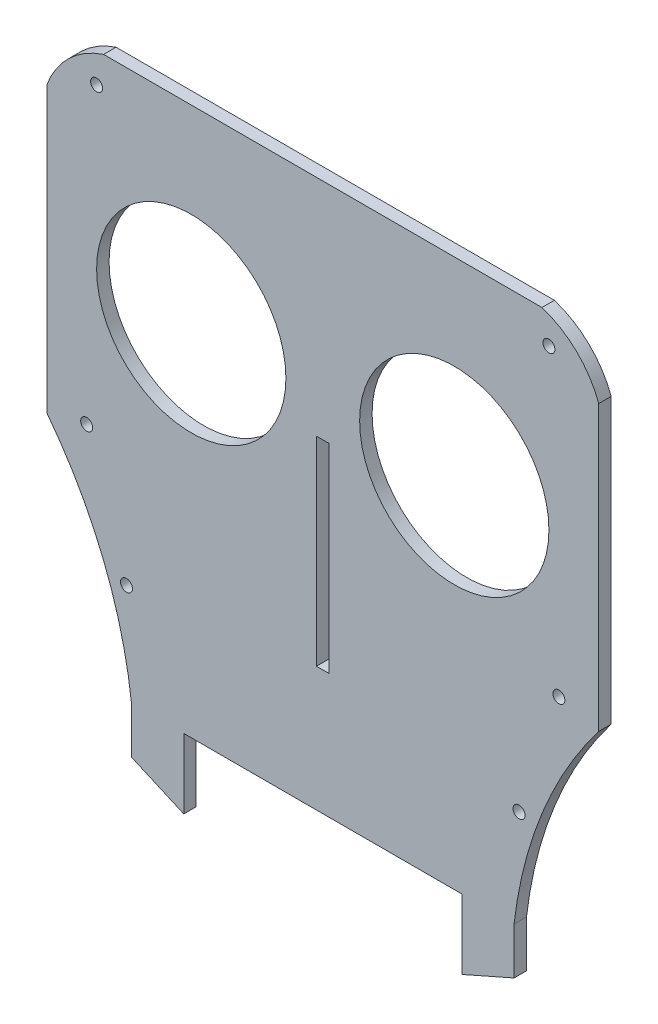
ISO-10303-21;
HEADER;
FILE_DESCRIPTION(('STEP AP214'),'2;1');
FILE_NAME('part.step','',(''),(''),'','','');
FILE_SCHEMA(('AUTOMOTIVE_DESIGN { 1 0 10303 214 1 1 1 1 }'));
ENDSEC;
DATA;
#1=APPLICATION_CONTEXT('core data for automotive mechanical design processes');
#2=APPLICATION_PROTOCOL_DEFINITION('international standard','automotive_design',2000,#1);
#3=PRODUCT_CONTEXT('',#1,'mechanical');
#4=PRODUCT('Part','Part','',(#3));
#5=PRODUCT_RELATED_PRODUCT_CATEGORY('part','',(#4));
#6=PRODUCT_DEFINITION_FORMATION('','',#4);
#7=PRODUCT_DEFINITION_CONTEXT('part definition',#1,'design');
#8=PRODUCT_DEFINITION('design','',#6,#7);
#9=PRODUCT_DEFINITION_SHAPE('','',#8);
#10=(LENGTH_UNIT() NAMED_UNIT(*) SI_UNIT(.MILLI.,.METRE.));
#11=(NAMED_UNIT(*) PLANE_ANGLE_UNIT() SI_UNIT($,.RADIAN.));
#12=(NAMED_UNIT(*) SI_UNIT($,.STERADIAN.) SOLID_ANGLE_UNIT());
#13=UNCERTAINTY_MEASURE_WITH_UNIT(LENGTH_MEASURE(1.E-05),#10,'distance_accuracy_value','');
#14=(GEOMETRIC_REPRESENTATION_CONTEXT(3) GLOBAL_UNCERTAINTY_ASSIGNED_CONTEXT((#13)) GLOBAL_UNIT_ASSIGNED_CONTEXT((#10,
#11,#12)) REPRESENTATION_CONTEXT('',''));
#15=CARTESIAN_POINT('',(0.,0.,0.));
#16=DIRECTION('',(0.,0.,1.));
#17=DIRECTION('',(1.,0.,0.));
#18=AXIS2_PLACEMENT_3D('',#15,#16,#17);
#19=CARTESIAN_POINT('',(-70.358,-139.7,3.175));
#20=DIRECTION('',(0.,1.,0.));
#21=DIRECTION('',(-1.,0.,0.));
#22=AXIS2_PLACEMENT_3D('',#19,#20,#21);
#23=PLANE('',#22);
#24=DIRECTION('',(0.,0.,1.));
#25=VECTOR('',#24,1.);
#26=CARTESIAN_POINT('',(35.433,-139.7,0.));
#27=LINE('',#26,#25);
#28=CARTESIAN_POINT('',(35.433,-139.7,0.));
#29=VERTEX_POINT('',#28);
#30=CARTESIAN_POINT('',(35.433,-139.7,3.175));
#31=VERTEX_POINT('',#30);
#32=EDGE_CURVE('E50',#29,#31,#27,.T.);
#33=ORIENTED_EDGE('',*,*,#32,.T.);
#34=DIRECTION('',(1.,0.,0.));
#35=VECTOR('',#34,1.);
#36=CARTESIAN_POINT('',(-70.358,-139.7,3.175));
#37=LINE('',#36,#35);
#38=CARTESIAN_POINT('',(-35.433,-139.7,3.175));
#39=VERTEX_POINT('',#38);
#40=EDGE_CURVE('E353',#39,#31,#37,.T.);
#41=ORIENTED_EDGE('',*,*,#40,.F.);
#42=DIRECTION('',(0.,0.,1.));
#43=VECTOR('',#42,1.);
#44=CARTESIAN_POINT('',(-35.433,-139.7,0.));
#45=LINE('',#44,#43);
#46=CARTESIAN_POINT('',(-35.433,-139.7,0.));
#47=VERTEX_POINT('',#46);
#48=EDGE_CURVE('E211',#47,#39,#45,.T.);
#49=ORIENTED_EDGE('',*,*,#48,.F.);
#50=DIRECTION('',(1.,0.,0.));
#51=VECTOR('',#50,1.);
#52=CARTESIAN_POINT('',(-70.358,-139.7,0.));
#53=LINE('',#52,#51);
#54=EDGE_CURVE('E55',#47,#29,#53,.T.);
#55=ORIENTED_EDGE('',*,*,#54,.T.);
#56=EDGE_LOOP('',(#33,#41,#49,#55));
#57=FACE_BOUND('',#56,.T.);
#58=ADVANCED_FACE('F33',(#57),#23,.F.);
#59=CARTESIAN_POINT('',(-70.358,-139.7,3.175));
#60=DIRECTION('',(0.,0.,1.));
#61=DIRECTION('',(1.,0.,0.));
#62=AXIS2_PLACEMENT_3D('',#59,#60,#61);
#63=PLANE('',#62);
#64=CARTESIAN_POINT('',(60.198,-83.82,3.175));
#65=DIRECTION('',(0.,0.,-1.));
#66=DIRECTION('',(-1.,0.,0.));
#67=AXIS2_PLACEMENT_3D('',#64,#65,#66);
#68=CIRCLE('',#67,1.52399999999999);
#69=CARTESIAN_POINT('',(58.674,-83.82,3.175));
#70=VERTEX_POINT('',#69);
#71=EDGE_CURVE('E232',#70,#70,#68,.T.);
#72=ORIENTED_EDGE('',*,*,#71,.T.);
#73=EDGE_LOOP('',(#72));
#74=FACE_BOUND('',#73,.T.);
#75=DIRECTION('',(0.,1.,0.));
#76=VECTOR('',#75,1.);
#77=CARTESIAN_POINT('',(70.358,0.,3.175));
#78=LINE('',#77,#76);
#79=CARTESIAN_POINT('',(70.358,-86.36,3.175));
#80=VERTEX_POINT('',#79);
#81=CARTESIAN_POINT('',(70.358,-13.97,3.175));
#82=VERTEX_POINT('',#81);
#83=EDGE_CURVE('E42',#80,#82,#78,.T.);
#84=ORIENTED_EDGE('',*,*,#83,.T.);
#85=CARTESIAN_POINT('',(48.7264391010209,-21.900926749851,3.175));
#86=DIRECTION('',(0.,0.,1.));
#87=DIRECTION('',(1.,0.,0.));
#88=AXIS2_PLACEMENT_3D('',#85,#86,#87);
#89=CIRCLE('',#88,23.0396186174542);
#90=CARTESIAN_POINT('',(55.88,0.,3.175));
#91=VERTEX_POINT('',#90);
#92=EDGE_CURVE('E262',#82,#91,#89,.T.);
#93=ORIENTED_EDGE('',*,*,#92,.T.);
#94=DIRECTION('',(-1.,0.,0.));
#95=VECTOR('',#94,1.);
#96=CARTESIAN_POINT('',(70.358,0.,3.175));
#97=LINE('',#96,#95);
#98=CARTESIAN_POINT('',(-55.88,0.,3.175));
#99=VERTEX_POINT('',#98);
#100=EDGE_CURVE('E11',#91,#99,#97,.T.);
#101=ORIENTED_EDGE('',*,*,#100,.T.);
#102=CARTESIAN_POINT('',(-48.7264391010209,-21.900926749851,3.175));
#103=DIRECTION('',(0.,0.,-1.));
#104=DIRECTION('',(-1.,0.,0.));
#105=AXIS2_PLACEMENT_3D('',#102,#103,#104);
#106=CIRCLE('',#105,23.0396186174542);
#107=CARTESIAN_POINT('',(-70.358,-13.97,3.175));
#108=VERTEX_POINT('',#107);
#109=EDGE_CURVE('E283',#108,#99,#106,.T.);
#110=ORIENTED_EDGE('',*,*,#109,.F.);
#111=DIRECTION('',(0.,-1.,0.));
#112=VECTOR('',#111,1.);
#113=CARTESIAN_POINT('',(-70.358,0.,3.175));
#114=LINE('',#113,#112);
#115=CARTESIAN_POINT('',(-70.358,-86.36,3.175));
#116=VERTEX_POINT('',#115);
#117=EDGE_CURVE('E351',#108,#116,#114,.T.);
#118=ORIENTED_EDGE('',*,*,#117,.T.);
#119=CARTESIAN_POINT('',(-156.00726826817,-152.066965727593,3.175));
#120=DIRECTION('',(0.,0.,1.));
#121=DIRECTION('',(-1.,0.,0.));
#122=AXIS2_PLACEMENT_3D('',#119,#120,#121);
#123=CIRCLE('',#122,107.95);
#124=CARTESIAN_POINT('',(-48.768,-139.7,3.175));
#125=VERTEX_POINT('',#124);
#126=EDGE_CURVE('E294',#125,#116,#123,.T.);
#127=ORIENTED_EDGE('',*,*,#126,.F.);
#128=DIRECTION('',(0.,-1.,0.));
#129=VECTOR('',#128,1.);
#130=CARTESIAN_POINT('',(-48.768,-151.596070027549,3.175));
#131=LINE('',#130,#129);
#132=CARTESIAN_POINT('',(-48.768,-151.596070027549,3.175));
#133=VERTEX_POINT('',#132);
#134=EDGE_CURVE('E190',#125,#133,#131,.T.);
#135=ORIENTED_EDGE('',*,*,#134,.T.);
#136=DIRECTION('',(0.914896473189709,-0.403688547453394,0.));
#137=VECTOR('',#136,1.);
#138=CARTESIAN_POINT('',(-35.433,-157.48,3.175));
#139=LINE('',#138,#137);
#140=CARTESIAN_POINT('',(-35.433,-157.48,3.175));
#141=VERTEX_POINT('',#140);
#142=EDGE_CURVE('E203',#133,#141,#139,.T.);
#143=ORIENTED_EDGE('',*,*,#142,.T.);
#144=DIRECTION('',(0.,1.,0.));
#145=VECTOR('',#144,1.);
#146=CARTESIAN_POINT('',(-35.433,-139.7,3.175));
#147=LINE('',#146,#145);
#148=EDGE_CURVE('E197',#141,#39,#147,.T.);
#149=ORIENTED_EDGE('',*,*,#148,.T.);
#150=ORIENTED_EDGE('',*,*,#40,.T.);
#151=DIRECTION('',(0.,1.,0.));
#152=VECTOR('',#151,1.);
#153=CARTESIAN_POINT('',(35.433,-139.7,3.175));
#154=LINE('',#153,#152);
#155=CARTESIAN_POINT('',(35.433,-157.48,3.175));
#156=VERTEX_POINT('',#155);
#157=EDGE_CURVE('E187',#156,#31,#154,.T.);
#158=ORIENTED_EDGE('',*,*,#157,.F.);
#159=DIRECTION('',(-0.914896473189709,-0.403688547453394,0.));
#160=VECTOR('',#159,1.);
#161=CARTESIAN_POINT('',(35.433,-157.48,3.175));
#162=LINE('',#161,#160);
#163=CARTESIAN_POINT('',(48.768,-151.596070027549,3.175));
#164=VERTEX_POINT('',#163);
#165=EDGE_CURVE('E174',#164,#156,#162,.T.);
#166=ORIENTED_EDGE('',*,*,#165,.F.);
#167=DIRECTION('',(0.,-1.,0.));
#168=VECTOR('',#167,1.);
#169=CARTESIAN_POINT('',(48.768,-151.596070027549,3.175));
#170=LINE('',#169,#168);
#171=CARTESIAN_POINT('',(48.768,-139.7,3.175));
#172=VERTEX_POINT('',#171);
#173=EDGE_CURVE('E184',#172,#164,#170,.T.);
#174=ORIENTED_EDGE('',*,*,#173,.F.);
#175=CARTESIAN_POINT('',(156.00726826817,-152.066965727593,3.175));
#176=DIRECTION('',(0.,0.,-1.));
#177=DIRECTION('',(1.,0.,0.));
#178=AXIS2_PLACEMENT_3D('',#175,#176,#177);
#179=CIRCLE('',#178,107.95);
#180=EDGE_CURVE('E273',#172,#80,#179,.T.);
#181=ORIENTED_EDGE('',*,*,#180,.T.);
#182=EDGE_LOOP('',(#84,#93,#101,#110,#118,#127,#135,#143,#149,#150,#158,#166,#174,#181));
#183=FACE_BOUND('',#182,.T.);
#184=CARTESIAN_POINT('',(33.528,-48.26,3.175));
#185=DIRECTION('',(0.,0.,-1.));
#186=DIRECTION('',(-1.,0.,0.));
#187=AXIS2_PLACEMENT_3D('',#184,#185,#186);
#188=CIRCLE('',#187,24.13);
#189=CARTESIAN_POINT('',(9.398,-48.26,3.175));
#190=VERTEX_POINT('',#189);
#191=EDGE_CURVE('E305',#190,#190,#188,.T.);
#192=ORIENTED_EDGE('',*,*,#191,.T.);
#193=EDGE_LOOP('',(#192));
#194=FACE_BOUND('',#193,.T.);
#195=DIRECTION('',(0.,-1.,0.));
#196=VECTOR('',#195,1.);
#197=CARTESIAN_POINT('',(-1.61289999999999,-57.15,3.175));
#198=LINE('',#197,#196);
#199=CARTESIAN_POINT('',(-1.61289999999999,-57.15,3.175));
#200=VERTEX_POINT('',#199);
#201=CARTESIAN_POINT('',(-1.61289999999999,-107.95,3.175));
#202=VERTEX_POINT('',#201);
#203=EDGE_CURVE('E310',#200,#202,#198,.T.);
#204=ORIENTED_EDGE('',*,*,#203,.F.);
#205=DIRECTION('',(-1.,0.,0.));
#206=VECTOR('',#205,1.);
#207=CARTESIAN_POINT('',(-1.61289999999999,-57.15,3.175));
#208=LINE('',#207,#206);
#209=CARTESIAN_POINT('',(1.61290000000001,-57.15,3.175));
#210=VERTEX_POINT('',#209);
#211=EDGE_CURVE('E317',#210,#200,#208,.T.);
#212=ORIENTED_EDGE('',*,*,#211,.F.);
#213=DIRECTION('',(0.,1.,0.));
#214=VECTOR('',#213,1.);
#215=CARTESIAN_POINT('',(1.61290000000001,-57.15,3.175));
#216=LINE('',#215,#214);
#217=CARTESIAN_POINT('',(1.61290000000001,-107.95,3.175));
#218=VERTEX_POINT('',#217);
#219=EDGE_CURVE('E331',#218,#210,#216,.T.);
#220=ORIENTED_EDGE('',*,*,#219,.F.);
#221=DIRECTION('',(1.,0.,0.));
#222=VECTOR('',#221,1.);
#223=CARTESIAN_POINT('',(-1.61289999999999,-107.95,3.175));
#224=LINE('',#223,#222);
#225=EDGE_CURVE('E328',#202,#218,#224,.T.);
#226=ORIENTED_EDGE('',*,*,#225,.F.);
#227=EDGE_LOOP('',(#204,#212,#220,#226));
#228=FACE_BOUND('',#227,.T.);
#229=CARTESIAN_POINT('',(-33.528,-48.26,3.175));
#230=DIRECTION('',(0.,0.,1.));
#231=DIRECTION('',(1.,0.,0.));
#232=AXIS2_PLACEMENT_3D('',#229,#230,#231);
#233=CIRCLE('',#232,24.13);
#234=CARTESIAN_POINT('',(-9.398,-48.26,3.175));
#235=VERTEX_POINT('',#234);
#236=EDGE_CURVE('E338',#235,#235,#233,.T.);
#237=ORIENTED_EDGE('',*,*,#236,.F.);
#238=EDGE_LOOP('',(#237));
#239=FACE_BOUND('',#238,.T.);
#240=CARTESIAN_POINT('',(-57.658,-7.62,3.175));
#241=DIRECTION('',(0.,0.,1.));
#242=DIRECTION('',(1.,0.,0.));
#243=AXIS2_PLACEMENT_3D('',#240,#241,#242);
#244=CIRCLE('',#243,1.52399999999999);
#245=CARTESIAN_POINT('',(-56.134,-7.62,3.175));
#246=VERTEX_POINT('',#245);
#247=EDGE_CURVE('E256',#246,#246,#244,.T.);
#248=ORIENTED_EDGE('',*,*,#247,.F.);
#249=EDGE_LOOP('',(#248));
#250=FACE_BOUND('',#249,.T.);
#251=CARTESIAN_POINT('',(-60.198,-83.82,3.175));
#252=DIRECTION('',(0.,0.,1.));
#253=DIRECTION('',(1.,0.,0.));
#254=AXIS2_PLACEMENT_3D('',#251,#252,#253);
#255=CIRCLE('',#254,1.52399999999999);
#256=CARTESIAN_POINT('',(-58.674,-83.82,3.175));
#257=VERTEX_POINT('',#256);
#258=EDGE_CURVE('E250',#257,#257,#255,.T.);
#259=ORIENTED_EDGE('',*,*,#258,.F.);
#260=EDGE_LOOP('',(#259));
#261=FACE_BOUND('',#260,.T.);
#262=CARTESIAN_POINT('',(-50.038,-114.3,3.175));
#263=DIRECTION('',(0.,0.,1.));
#264=DIRECTION('',(1.,0.,0.));
#265=AXIS2_PLACEMENT_3D('',#262,#263,#264);
#266=CIRCLE('',#265,1.524);
#267=CARTESIAN_POINT('',(-48.514,-114.3,3.175));
#268=VERTEX_POINT('',#267);
#269=EDGE_CURVE('E244',#268,#268,#266,.T.);
#270=ORIENTED_EDGE('',*,*,#269,.F.);
#271=EDGE_LOOP('',(#270));
#272=FACE_BOUND('',#271,.T.);
#273=CARTESIAN_POINT('',(57.658,-7.62,3.175));
#274=DIRECTION('',(0.,0.,-1.));
#275=DIRECTION('',(-1.,0.,0.));
#276=AXIS2_PLACEMENT_3D('',#273,#274,#275);
#277=CIRCLE('',#276,1.52399999999999);
#278=CARTESIAN_POINT('',(56.134,-7.62,3.175));
#279=VERTEX_POINT('',#278);
#280=EDGE_CURVE('E238',#279,#279,#277,.T.);
#281=ORIENTED_EDGE('',*,*,#280,.T.);
#282=EDGE_LOOP('',(#281));
#283=FACE_BOUND('',#282,.T.);
#284=CARTESIAN_POINT('',(50.038,-114.3,3.175));
#285=DIRECTION('',(0.,0.,-1.));
#286=DIRECTION('',(-1.,0.,0.));
#287=AXIS2_PLACEMENT_3D('',#284,#285,#286);
#288=CIRCLE('',#287,1.524);
#289=CARTESIAN_POINT('',(48.514,-114.3,3.175));
#290=VERTEX_POINT('',#289);
#291=EDGE_CURVE('E215',#290,#290,#288,.T.);
#292=ORIENTED_EDGE('',*,*,#291,.T.);
#293=EDGE_LOOP('',(#292));
#294=FACE_BOUND('',#293,.T.);
#295=ADVANCED_FACE('F377',(#74,#183,#194,#228,#239,#250,#261,#272,#283,#294),#63,.T.);
#296=CARTESIAN_POINT('',(-70.358,-139.7,0.));
#297=DIRECTION('',(0.,0.,1.));
#298=DIRECTION('',(1.,0.,0.));
#299=AXIS2_PLACEMENT_3D('',#296,#297,#298);
#300=PLANE('',#299);
#301=CARTESIAN_POINT('',(60.198,-83.82,0.));
#302=DIRECTION('',(0.,0.,-1.));
#303=DIRECTION('',(-1.,0.,0.));
#304=AXIS2_PLACEMENT_3D('',#301,#302,#303);
#305=CIRCLE('',#304,1.52399999999999);
#306=CARTESIAN_POINT('',(58.674,-83.82,0.));
#307=VERTEX_POINT('',#306);
#308=EDGE_CURVE('E235',#307,#307,#305,.T.);
#309=ORIENTED_EDGE('',*,*,#308,.F.);
#310=EDGE_LOOP('',(#309));
#311=FACE_BOUND('',#310,.T.);
#312=CARTESIAN_POINT('',(48.7264391010209,-21.900926749851,0.));
#313=DIRECTION('',(0.,0.,1.));
#314=DIRECTION('',(1.,0.,0.));
#315=AXIS2_PLACEMENT_3D('',#312,#313,#314);
#316=CIRCLE('',#315,23.0396186174542);
#317=CARTESIAN_POINT('',(70.358,-13.97,0.));
#318=VERTEX_POINT('',#317);
#319=CARTESIAN_POINT('',(55.88,0.,0.));
#320=VERTEX_POINT('',#319);
#321=EDGE_CURVE('E265',#318,#320,#316,.T.);
#322=ORIENTED_EDGE('',*,*,#321,.F.);
#323=DIRECTION('',(0.,1.,0.));
#324=VECTOR('',#323,1.);
#325=CARTESIAN_POINT('',(70.358,0.,0.));
#326=LINE('',#325,#324);
#327=CARTESIAN_POINT('',(70.358,-86.36,0.));
#328=VERTEX_POINT('',#327);
#329=EDGE_CURVE('E359',#328,#318,#326,.T.);
#330=ORIENTED_EDGE('',*,*,#329,.F.);
#331=CARTESIAN_POINT('',(156.00726826817,-152.066965727593,0.));
#332=DIRECTION('',(0.,0.,-1.));
#333=DIRECTION('',(1.,0.,0.));
#334=AXIS2_PLACEMENT_3D('',#331,#332,#333);
#335=CIRCLE('',#334,107.95);
#336=CARTESIAN_POINT('',(48.768,-139.7,0.));
#337=VERTEX_POINT('',#336);
#338=EDGE_CURVE('E275',#337,#328,#335,.T.);
#339=ORIENTED_EDGE('',*,*,#338,.F.);
#340=DIRECTION('',(0.,-1.,0.));
#341=VECTOR('',#340,1.);
#342=CARTESIAN_POINT('',(48.768,-151.596070027549,0.));
#343=LINE('',#342,#341);
#344=CARTESIAN_POINT('',(48.768,-151.596070027549,0.));
#345=VERTEX_POINT('',#344);
#346=EDGE_CURVE('E166',#337,#345,#343,.T.);
#347=ORIENTED_EDGE('',*,*,#346,.T.);
#348=DIRECTION('',(-0.914896473189709,-0.403688547453394,0.));
#349=VECTOR('',#348,1.);
#350=CARTESIAN_POINT('',(35.433,-157.48,0.));
#351=LINE('',#350,#349);
#352=CARTESIAN_POINT('',(35.433,-157.48,0.));
#353=VERTEX_POINT('',#352);
#354=EDGE_CURVE('E157',#345,#353,#351,.T.);
#355=ORIENTED_EDGE('',*,*,#354,.T.);
#356=DIRECTION('',(0.,1.,0.));
#357=VECTOR('',#356,1.);
#358=CARTESIAN_POINT('',(35.433,-139.7,0.));
#359=LINE('',#358,#357);
#360=EDGE_CURVE('E163',#353,#29,#359,.T.);
#361=ORIENTED_EDGE('',*,*,#360,.T.);
#362=ORIENTED_EDGE('',*,*,#54,.F.);
#363=DIRECTION('',(0.,1.,0.));
#364=VECTOR('',#363,1.);
#365=CARTESIAN_POINT('',(-35.433,-139.7,0.));
#366=LINE('',#365,#364);
#367=CARTESIAN_POINT('',(-35.433,-157.48,0.));
#368=VERTEX_POINT('',#367);
#369=EDGE_CURVE('E200',#368,#47,#366,.T.);
#370=ORIENTED_EDGE('',*,*,#369,.F.);
#371=DIRECTION('',(0.914896473189709,-0.403688547453394,0.));
#372=VECTOR('',#371,1.);
#373=CARTESIAN_POINT('',(-35.433,-157.48,0.));
#374=LINE('',#373,#372);
#375=CARTESIAN_POINT('',(-48.768,-151.596070027549,0.));
#376=VERTEX_POINT('',#375);
#377=EDGE_CURVE('E196',#376,#368,#374,.T.);
#378=ORIENTED_EDGE('',*,*,#377,.F.);
#379=DIRECTION('',(0.,-1.,0.));
#380=VECTOR('',#379,1.);
#381=CARTESIAN_POINT('',(-48.768,-151.596070027549,0.));
#382=LINE('',#381,#380);
#383=CARTESIAN_POINT('',(-48.768,-139.7,0.));
#384=VERTEX_POINT('',#383);
#385=EDGE_CURVE('E193',#384,#376,#382,.T.);
#386=ORIENTED_EDGE('',*,*,#385,.F.);
#387=CARTESIAN_POINT('',(-156.00726826817,-152.066965727593,0.));
#388=DIRECTION('',(0.,0.,1.));
#389=DIRECTION('',(-1.,0.,0.));
#390=AXIS2_PLACEMENT_3D('',#387,#388,#389);
#391=CIRCLE('',#390,107.95);
#392=CARTESIAN_POINT('',(-70.358,-86.36,0.));
#393=VERTEX_POINT('',#392);
#394=EDGE_CURVE('E296',#384,#393,#391,.T.);
#395=ORIENTED_EDGE('',*,*,#394,.T.);
#396=DIRECTION('',(0.,-1.,0.));
#397=VECTOR('',#396,1.);
#398=CARTESIAN_POINT('',(-70.358,0.,0.));
#399=LINE('',#398,#397);
#400=CARTESIAN_POINT('',(-70.358,-13.97,0.));
#401=VERTEX_POINT('',#400);
#402=EDGE_CURVE('E348',#401,#393,#399,.T.);
#403=ORIENTED_EDGE('',*,*,#402,.F.);
#404=CARTESIAN_POINT('',(-48.7264391010209,-21.900926749851,0.));
#405=DIRECTION('',(0.,0.,-1.));
#406=DIRECTION('',(-1.,0.,0.));
#407=AXIS2_PLACEMENT_3D('',#404,#405,#406);
#408=CIRCLE('',#407,23.0396186174542);
#409=CARTESIAN_POINT('',(-55.88,0.,0.));
#410=VERTEX_POINT('',#409);
#411=EDGE_CURVE('E285',#401,#410,#408,.T.);
#412=ORIENTED_EDGE('',*,*,#411,.T.);
#413=DIRECTION('',(-1.,0.,0.));
#414=VECTOR('',#413,1.);
#415=CARTESIAN_POINT('',(70.358,0.,0.));
#416=LINE('',#415,#414);
#417=EDGE_CURVE('E354',#320,#410,#416,.T.);
#418=ORIENTED_EDGE('',*,*,#417,.F.);
#419=EDGE_LOOP('',(#322,#330,#339,#347,#355,#361,#362,#370,#378,#386,#395,#403,#412,#418));
#420=FACE_BOUND('',#419,.T.);
#421=CARTESIAN_POINT('',(33.528,-48.26,0.));
#422=DIRECTION('',(0.,0.,-1.));
#423=DIRECTION('',(-1.,0.,0.));
#424=AXIS2_PLACEMENT_3D('',#421,#422,#423);
#425=CIRCLE('',#424,24.13);
#426=CARTESIAN_POINT('',(9.398,-48.26,0.));
#427=VERTEX_POINT('',#426);
#428=EDGE_CURVE('E307',#427,#427,#425,.T.);
#429=ORIENTED_EDGE('',*,*,#428,.F.);
#430=EDGE_LOOP('',(#429));
#431=FACE_BOUND('',#430,.T.);
#432=DIRECTION('',(-1.,0.,0.));
#433=VECTOR('',#432,1.);
#434=CARTESIAN_POINT('',(-1.61289999999999,-57.15,0.));
#435=LINE('',#434,#433);
#436=CARTESIAN_POINT('',(1.61290000000001,-57.15,0.));
#437=VERTEX_POINT('',#436);
#438=CARTESIAN_POINT('',(-1.61289999999999,-57.15,0.));
#439=VERTEX_POINT('',#438);
#440=EDGE_CURVE('E323',#437,#439,#435,.T.);
#441=ORIENTED_EDGE('',*,*,#440,.T.);
#442=DIRECTION('',(0.,-1.,0.));
#443=VECTOR('',#442,1.);
#444=CARTESIAN_POINT('',(-1.61289999999999,-57.15,0.));
#445=LINE('',#444,#443);
#446=CARTESIAN_POINT('',(-1.61289999999999,-107.95,0.));
#447=VERTEX_POINT('',#446);
#448=EDGE_CURVE('E313',#439,#447,#445,.T.);
#449=ORIENTED_EDGE('',*,*,#448,.T.);
#450=DIRECTION('',(1.,0.,0.));
#451=VECTOR('',#450,1.);
#452=CARTESIAN_POINT('',(-1.61289999999999,-107.95,0.));
#453=LINE('',#452,#451);
#454=CARTESIAN_POINT('',(1.61290000000001,-107.95,0.));
#455=VERTEX_POINT('',#454);
#456=EDGE_CURVE('E316',#447,#455,#453,.T.);
#457=ORIENTED_EDGE('',*,*,#456,.T.);
#458=DIRECTION('',(0.,1.,0.));
#459=VECTOR('',#458,1.);
#460=CARTESIAN_POINT('',(1.61290000000001,-57.15,0.));
#461=LINE('',#460,#459);
#462=EDGE_CURVE('E320',#455,#437,#461,.T.);
#463=ORIENTED_EDGE('',*,*,#462,.T.);
#464=EDGE_LOOP('',(#441,#449,#457,#463));
#465=FACE_BOUND('',#464,.T.);
#466=CARTESIAN_POINT('',(-33.528,-48.26,0.));
#467=DIRECTION('',(0.,0.,1.));
#468=DIRECTION('',(1.,0.,0.));
#469=AXIS2_PLACEMENT_3D('',#466,#467,#468);
#470=CIRCLE('',#469,24.13);
#471=CARTESIAN_POINT('',(-9.398,-48.26,0.));
#472=VERTEX_POINT('',#471);
#473=EDGE_CURVE('E345',#472,#472,#470,.T.);
#474=ORIENTED_EDGE('',*,*,#473,.T.);
#475=EDGE_LOOP('',(#474));
#476=FACE_BOUND('',#475,.T.);
#477=CARTESIAN_POINT('',(-57.658,-7.62,0.));
#478=DIRECTION('',(0.,0.,1.));
#479=DIRECTION('',(1.,0.,0.));
#480=AXIS2_PLACEMENT_3D('',#477,#478,#479);
#481=CIRCLE('',#480,1.52399999999999);
#482=CARTESIAN_POINT('',(-56.134,-7.62,0.));
#483=VERTEX_POINT('',#482);
#484=EDGE_CURVE('E259',#483,#483,#481,.T.);
#485=ORIENTED_EDGE('',*,*,#484,.T.);
#486=EDGE_LOOP('',(#485));
#487=FACE_BOUND('',#486,.T.);
#488=CARTESIAN_POINT('',(-60.198,-83.82,0.));
#489=DIRECTION('',(0.,0.,1.));
#490=DIRECTION('',(1.,0.,0.));
#491=AXIS2_PLACEMENT_3D('',#488,#489,#490);
#492=CIRCLE('',#491,1.52399999999999);
#493=CARTESIAN_POINT('',(-58.674,-83.82,0.));
#494=VERTEX_POINT('',#493);
#495=EDGE_CURVE('E253',#494,#494,#492,.T.);
#496=ORIENTED_EDGE('',*,*,#495,.T.);
#497=EDGE_LOOP('',(#496));
#498=FACE_BOUND('',#497,.T.);
#499=CARTESIAN_POINT('',(-50.038,-114.3,0.));
#500=DIRECTION('',(0.,0.,1.));
#501=DIRECTION('',(1.,0.,0.));
#502=AXIS2_PLACEMENT_3D('',#499,#500,#501);
#503=CIRCLE('',#502,1.524);
#504=CARTESIAN_POINT('',(-48.514,-114.3,0.));
#505=VERTEX_POINT('',#504);
#506=EDGE_CURVE('E247',#505,#505,#503,.T.);
#507=ORIENTED_EDGE('',*,*,#506,.T.);
#508=EDGE_LOOP('',(#507));
#509=FACE_BOUND('',#508,.T.);
#510=CARTESIAN_POINT('',(57.658,-7.62,0.));
#511=DIRECTION('',(0.,0.,-1.));
#512=DIRECTION('',(-1.,0.,0.));
#513=AXIS2_PLACEMENT_3D('',#510,#511,#512);
#514=CIRCLE('',#513,1.52399999999999);
#515=CARTESIAN_POINT('',(56.134,-7.62,0.));
#516=VERTEX_POINT('',#515);
#517=EDGE_CURVE('E241',#516,#516,#514,.T.);
#518=ORIENTED_EDGE('',*,*,#517,.F.);
#519=EDGE_LOOP('',(#518));
#520=FACE_BOUND('',#519,.T.);
#521=CARTESIAN_POINT('',(50.038,-114.3,0.));
#522=DIRECTION('',(0.,0.,-1.));
#523=DIRECTION('',(-1.,0.,0.));
#524=AXIS2_PLACEMENT_3D('',#521,#522,#523);
#525=CIRCLE('',#524,1.524);
#526=CARTESIAN_POINT('',(48.514,-114.3,0.));
#527=VERTEX_POINT('',#526);
#528=EDGE_CURVE('E229',#527,#527,#525,.T.);
#529=ORIENTED_EDGE('',*,*,#528,.F.);
#530=EDGE_LOOP('',(#529));
#531=FACE_BOUND('',#530,.T.);
#532=ADVANCED_FACE('F160',(#311,#420,#431,#465,#476,#487,#498,#509,#520,#531),#300,.F.);
#533=CARTESIAN_POINT('',(70.358,0.,3.175));
#534=DIRECTION('',(-1.,0.,0.));
#535=DIRECTION('',(0.,-1.,0.));
#536=AXIS2_PLACEMENT_3D('',#533,#534,#535);
#537=PLANE('',#536);
#538=DIRECTION('',(0.,0.,1.));
#539=VECTOR('',#538,1.);
#540=CARTESIAN_POINT('',(70.358,-13.97,0.));
#541=LINE('',#540,#539);
#542=EDGE_CURVE('E270',#318,#82,#541,.T.);
#543=ORIENTED_EDGE('',*,*,#542,.T.);
#544=ORIENTED_EDGE('',*,*,#83,.F.);
#545=DIRECTION('',(0.,0.,1.));
#546=VECTOR('',#545,1.);
#547=CARTESIAN_POINT('',(70.358,-86.36,0.));
#548=LINE('',#547,#546);
#549=EDGE_CURVE('E277',#328,#80,#548,.T.);
#550=ORIENTED_EDGE('',*,*,#549,.F.);
#551=ORIENTED_EDGE('',*,*,#329,.T.);
#552=EDGE_LOOP('',(#543,#544,#550,#551));
#553=FACE_BOUND('',#552,.T.);
#554=ADVANCED_FACE('F392',(#553),#537,.F.);
#555=CARTESIAN_POINT('',(70.358,0.,3.175));
#556=DIRECTION('',(0.,-1.,0.));
#557=DIRECTION('',(1.,0.,0.));
#558=AXIS2_PLACEMENT_3D('',#555,#556,#557);
#559=PLANE('',#558);
#560=DIRECTION('',(0.,0.,1.));
#561=VECTOR('',#560,1.);
#562=CARTESIAN_POINT('',(55.88,0.,0.));
#563=LINE('',#562,#561);
#564=EDGE_CURVE('E267',#320,#91,#563,.T.);
#565=ORIENTED_EDGE('',*,*,#564,.F.);
#566=ORIENTED_EDGE('',*,*,#417,.T.);
#567=DIRECTION('',(0.,0.,1.));
#568=VECTOR('',#567,1.);
#569=CARTESIAN_POINT('',(-55.88,0.,0.));
#570=LINE('',#569,#568);
#571=EDGE_CURVE('E291',#410,#99,#570,.T.);
#572=ORIENTED_EDGE('',*,*,#571,.T.);
#573=ORIENTED_EDGE('',*,*,#100,.F.);
#574=EDGE_LOOP('',(#565,#566,#572,#573));
#575=FACE_BOUND('',#574,.T.);
#576=ADVANCED_FACE('F386',(#575),#559,.F.);
#577=CARTESIAN_POINT('',(-70.358,0.,3.175));
#578=DIRECTION('',(1.,0.,0.));
#579=DIRECTION('',(0.,0.,-1.));
#580=AXIS2_PLACEMENT_3D('',#577,#578,#579);
#581=PLANE('',#580);
#582=ORIENTED_EDGE('',*,*,#117,.F.);
#583=DIRECTION('',(0.,0.,1.));
#584=VECTOR('',#583,1.);
#585=CARTESIAN_POINT('',(-70.358,-13.97,0.));
#586=LINE('',#585,#584);
#587=EDGE_CURVE('E288',#401,#108,#586,.T.);
#588=ORIENTED_EDGE('',*,*,#587,.F.);
#589=ORIENTED_EDGE('',*,*,#402,.T.);
#590=DIRECTION('',(0.,0.,1.));
#591=VECTOR('',#590,1.);
#592=CARTESIAN_POINT('',(-70.358,-86.36,0.));
#593=LINE('',#592,#591);
#594=EDGE_CURVE('E302',#393,#116,#593,.T.);
#595=ORIENTED_EDGE('',*,*,#594,.T.);
#596=EDGE_LOOP('',(#582,#588,#589,#595));
#597=FACE_BOUND('',#596,.T.);
#598=ADVANCED_FACE('F35',(#597),#581,.F.);
#599=CARTESIAN_POINT('',(-33.528,-48.26,0.));
#600=DIRECTION('',(0.,0.,1.));
#601=DIRECTION('',(1.,0.,0.));
#602=AXIS2_PLACEMENT_3D('',#599,#600,#601);
#603=CYLINDRICAL_SURFACE('',#602,24.13);
#604=ORIENTED_EDGE('',*,*,#473,.F.);
#605=EDGE_LOOP('',(#604));
#606=FACE_BOUND('',#605,.T.);
#607=ORIENTED_EDGE('',*,*,#236,.T.);
#608=EDGE_LOOP('',(#607));
#609=FACE_BOUND('',#608,.T.);
#610=ADVANCED_FACE('F426',(#606,#609),#603,.F.);
#611=CARTESIAN_POINT('',(-1.61289999999999,-57.15,0.));
#612=DIRECTION('',(-1.,0.,0.));
#613=DIRECTION('',(0.,-1.,0.));
#614=AXIS2_PLACEMENT_3D('',#611,#612,#613);
#615=PLANE('',#614);
#616=ORIENTED_EDGE('',*,*,#203,.T.);
#617=DIRECTION('',(0.,0.,1.));
#618=VECTOR('',#617,1.);
#619=CARTESIAN_POINT('',(-1.61289999999999,-107.95,0.));
#620=LINE('',#619,#618);
#621=EDGE_CURVE('E326',#447,#202,#620,.T.);
#622=ORIENTED_EDGE('',*,*,#621,.F.);
#623=ORIENTED_EDGE('',*,*,#448,.F.);
#624=DIRECTION('',(0.,0.,1.));
#625=VECTOR('',#624,1.);
#626=CARTESIAN_POINT('',(-1.61289999999999,-57.15,0.));
#627=LINE('',#626,#625);
#628=EDGE_CURVE('E336',#439,#200,#627,.T.);
#629=ORIENTED_EDGE('',*,*,#628,.T.);
#630=EDGE_LOOP('',(#616,#622,#623,#629));
#631=FACE_BOUND('',#630,.T.);
#632=ADVANCED_FACE('F429',(#631),#615,.F.);
#633=CARTESIAN_POINT('',(-1.61289999999999,-57.15,0.));
#634=DIRECTION('',(0.,1.,0.));
#635=DIRECTION('',(0.,0.,1.));
#636=AXIS2_PLACEMENT_3D('',#633,#634,#635);
#637=PLANE('',#636);
#638=ORIENTED_EDGE('',*,*,#211,.T.);
#639=ORIENTED_EDGE('',*,*,#628,.F.);
#640=ORIENTED_EDGE('',*,*,#440,.F.);
#641=DIRECTION('',(0.,0.,1.));
#642=VECTOR('',#641,1.);
#643=CARTESIAN_POINT('',(1.61290000000001,-57.15,0.));
#644=LINE('',#643,#642);
#645=EDGE_CURVE('E339',#437,#210,#644,.T.);
#646=ORIENTED_EDGE('',*,*,#645,.T.);
#647=EDGE_LOOP('',(#638,#639,#640,#646));
#648=FACE_BOUND('',#647,.T.);
#649=ADVANCED_FACE('F433',(#648),#637,.F.);
#650=CARTESIAN_POINT('',(1.61290000000001,-57.15,0.));
#651=DIRECTION('',(1.,0.,0.));
#652=DIRECTION('',(0.,1.,0.));
#653=AXIS2_PLACEMENT_3D('',#650,#651,#652);
#654=PLANE('',#653);
#655=ORIENTED_EDGE('',*,*,#219,.T.);
#656=ORIENTED_EDGE('',*,*,#645,.F.);
#657=ORIENTED_EDGE('',*,*,#462,.F.);
#658=DIRECTION('',(0.,0.,1.));
#659=VECTOR('',#658,1.);
#660=CARTESIAN_POINT('',(1.61290000000001,-107.95,0.));
#661=LINE('',#660,#659);
#662=EDGE_CURVE('E341',#455,#218,#661,.T.);
#663=ORIENTED_EDGE('',*,*,#662,.T.);
#664=EDGE_LOOP('',(#655,#656,#657,#663));
#665=FACE_BOUND('',#664,.T.);
#666=ADVANCED_FACE('F439',(#665),#654,.F.);
#667=CARTESIAN_POINT('',(-1.61289999999999,-107.95,0.));
#668=DIRECTION('',(0.,-1.,0.));
#669=DIRECTION('',(0.,0.,-1.));
#670=AXIS2_PLACEMENT_3D('',#667,#668,#669);
#671=PLANE('',#670);
#672=ORIENTED_EDGE('',*,*,#225,.T.);
#673=ORIENTED_EDGE('',*,*,#662,.F.);
#674=ORIENTED_EDGE('',*,*,#456,.F.);
#675=ORIENTED_EDGE('',*,*,#621,.T.);
#676=EDGE_LOOP('',(#672,#673,#674,#675));
#677=FACE_BOUND('',#676,.T.);
#678=ADVANCED_FACE('F435',(#677),#671,.F.);
#679=CARTESIAN_POINT('',(33.528,-48.26,0.));
#680=DIRECTION('',(0.,0.,1.));
#681=DIRECTION('',(1.,0.,0.));
#682=AXIS2_PLACEMENT_3D('',#679,#680,#681);
#683=CYLINDRICAL_SURFACE('',#682,24.13);
#684=ORIENTED_EDGE('',*,*,#428,.T.);
#685=EDGE_LOOP('',(#684));
#686=FACE_BOUND('',#685,.T.);
#687=ORIENTED_EDGE('',*,*,#191,.F.);
#688=EDGE_LOOP('',(#687));
#689=FACE_BOUND('',#688,.T.);
#690=ADVANCED_FACE('F438',(#686,#689),#683,.F.);
#691=CARTESIAN_POINT('',(-156.00726826817,-152.066965727593,0.));
#692=DIRECTION('',(0.,0.,1.));
#693=DIRECTION('',(1.,0.,0.));
#694=AXIS2_PLACEMENT_3D('',#691,#692,#693);
#695=CYLINDRICAL_SURFACE('',#694,107.95);
#696=ORIENTED_EDGE('',*,*,#126,.T.);
#697=ORIENTED_EDGE('',*,*,#594,.F.);
#698=ORIENTED_EDGE('',*,*,#394,.F.);
#699=DIRECTION('',(0.,0.,1.));
#700=VECTOR('',#699,1.);
#701=CARTESIAN_POINT('',(-48.768,-139.7,0.));
#702=LINE('',#701,#700);
#703=EDGE_CURVE('E299',#384,#125,#702,.T.);
#704=ORIENTED_EDGE('',*,*,#703,.T.);
#705=EDGE_LOOP('',(#696,#697,#698,#704));
#706=FACE_BOUND('',#705,.T.);
#707=ADVANCED_FACE('F369',(#706),#695,.F.);
#708=CARTESIAN_POINT('',(-48.7264391010209,-21.900926749851,0.));
#709=DIRECTION('',(0.,0.,1.));
#710=DIRECTION('',(1.,0.,0.));
#711=AXIS2_PLACEMENT_3D('',#708,#709,#710);
#712=CYLINDRICAL_SURFACE('',#711,23.0396186174542);
#713=ORIENTED_EDGE('',*,*,#109,.T.);
#714=ORIENTED_EDGE('',*,*,#571,.F.);
#715=ORIENTED_EDGE('',*,*,#411,.F.);
#716=ORIENTED_EDGE('',*,*,#587,.T.);
#717=EDGE_LOOP('',(#713,#714,#715,#716));
#718=FACE_BOUND('',#717,.T.);
#719=ADVANCED_FACE('F383',(#718),#712,.T.);
#720=CARTESIAN_POINT('',(156.00726826817,-152.066965727593,0.));
#721=DIRECTION('',(0.,0.,1.));
#722=DIRECTION('',(1.,0.,0.));
#723=AXIS2_PLACEMENT_3D('',#720,#721,#722);
#724=CYLINDRICAL_SURFACE('',#723,107.95);
#725=ORIENTED_EDGE('',*,*,#180,.F.);
#726=DIRECTION('',(0.,0.,1.));
#727=VECTOR('',#726,1.);
#728=CARTESIAN_POINT('',(48.768,-139.7,0.));
#729=LINE('',#728,#727);
#730=EDGE_CURVE('E280',#337,#172,#729,.T.);
#731=ORIENTED_EDGE('',*,*,#730,.F.);
#732=ORIENTED_EDGE('',*,*,#338,.T.);
#733=ORIENTED_EDGE('',*,*,#549,.T.);
#734=EDGE_LOOP('',(#725,#731,#732,#733));
#735=FACE_BOUND('',#734,.T.);
#736=ADVANCED_FACE('F395',(#735),#724,.F.);
#737=CARTESIAN_POINT('',(48.7264391010209,-21.900926749851,0.));
#738=DIRECTION('',(0.,0.,1.));
#739=DIRECTION('',(1.,0.,0.));
#740=AXIS2_PLACEMENT_3D('',#737,#738,#739);
#741=CYLINDRICAL_SURFACE('',#740,23.0396186174542);
#742=ORIENTED_EDGE('',*,*,#92,.F.);
#743=ORIENTED_EDGE('',*,*,#542,.F.);
#744=ORIENTED_EDGE('',*,*,#321,.T.);
#745=ORIENTED_EDGE('',*,*,#564,.T.);
#746=EDGE_LOOP('',(#742,#743,#744,#745));
#747=FACE_BOUND('',#746,.T.);
#748=ADVANCED_FACE('F456',(#747),#741,.T.);
#749=CARTESIAN_POINT('',(-57.658,-7.62,0.));
#750=DIRECTION('',(0.,0.,1.));
#751=DIRECTION('',(1.,0.,0.));
#752=AXIS2_PLACEMENT_3D('',#749,#750,#751);
#753=CYLINDRICAL_SURFACE('',#752,1.52399999999999);
#754=ORIENTED_EDGE('',*,*,#484,.F.);
#755=EDGE_LOOP('',(#754));
#756=FACE_BOUND('',#755,.T.);
#757=ORIENTED_EDGE('',*,*,#247,.T.);
#758=EDGE_LOOP('',(#757));
#759=FACE_BOUND('',#758,.T.);
#760=ADVANCED_FACE('F459',(#756,#759),#753,.F.);
#761=CARTESIAN_POINT('',(-60.198,-83.82,0.));
#762=DIRECTION('',(0.,0.,1.));
#763=DIRECTION('',(1.,0.,0.));
#764=AXIS2_PLACEMENT_3D('',#761,#762,#763);
#765=CYLINDRICAL_SURFACE('',#764,1.52399999999999);
#766=ORIENTED_EDGE('',*,*,#495,.F.);
#767=EDGE_LOOP('',(#766));
#768=FACE_BOUND('',#767,.T.);
#769=ORIENTED_EDGE('',*,*,#258,.T.);
#770=EDGE_LOOP('',(#769));
#771=FACE_BOUND('',#770,.T.);
#772=ADVANCED_FACE('F462',(#768,#771),#765,.F.);
#773=CARTESIAN_POINT('',(-50.038,-114.3,0.));
#774=DIRECTION('',(0.,0.,1.));
#775=DIRECTION('',(1.,0.,0.));
#776=AXIS2_PLACEMENT_3D('',#773,#774,#775);
#777=CYLINDRICAL_SURFACE('',#776,1.524);
#778=ORIENTED_EDGE('',*,*,#506,.F.);
#779=EDGE_LOOP('',(#778));
#780=FACE_BOUND('',#779,.T.);
#781=ORIENTED_EDGE('',*,*,#269,.T.);
#782=EDGE_LOOP('',(#781));
#783=FACE_BOUND('',#782,.T.);
#784=ADVANCED_FACE('F466',(#780,#783),#777,.F.);
#785=CARTESIAN_POINT('',(57.658,-7.62,0.));
#786=DIRECTION('',(0.,0.,1.));
#787=DIRECTION('',(1.,0.,0.));
#788=AXIS2_PLACEMENT_3D('',#785,#786,#787);
#789=CYLINDRICAL_SURFACE('',#788,1.52399999999999);
#790=ORIENTED_EDGE('',*,*,#517,.T.);
#791=EDGE_LOOP('',(#790));
#792=FACE_BOUND('',#791,.T.);
#793=ORIENTED_EDGE('',*,*,#280,.F.);
#794=EDGE_LOOP('',(#793));
#795=FACE_BOUND('',#794,.T.);
#796=ADVANCED_FACE('F470',(#792,#795),#789,.F.);
#797=CARTESIAN_POINT('',(60.198,-83.82,0.));
#798=DIRECTION('',(0.,0.,1.));
#799=DIRECTION('',(1.,0.,0.));
#800=AXIS2_PLACEMENT_3D('',#797,#798,#799);
#801=CYLINDRICAL_SURFACE('',#800,1.52399999999999);
#802=ORIENTED_EDGE('',*,*,#308,.T.);
#803=EDGE_LOOP('',(#802));
#804=FACE_BOUND('',#803,.T.);
#805=ORIENTED_EDGE('',*,*,#71,.F.);
#806=EDGE_LOOP('',(#805));
#807=FACE_BOUND('',#806,.T.);
#808=ADVANCED_FACE('F474',(#804,#807),#801,.F.);
#809=CARTESIAN_POINT('',(50.038,-114.3,0.));
#810=DIRECTION('',(0.,0.,1.));
#811=DIRECTION('',(1.,0.,0.));
#812=AXIS2_PLACEMENT_3D('',#809,#810,#811);
#813=CYLINDRICAL_SURFACE('',#812,1.524);
#814=ORIENTED_EDGE('',*,*,#528,.T.);
#815=EDGE_LOOP('',(#814));
#816=FACE_BOUND('',#815,.T.);
#817=ORIENTED_EDGE('',*,*,#291,.F.);
#818=EDGE_LOOP('',(#817));
#819=FACE_BOUND('',#818,.T.);
#820=ADVANCED_FACE('F478',(#816,#819),#813,.F.);
#821=CARTESIAN_POINT('',(-48.768,-151.596070027549,0.));
#822=DIRECTION('',(-1.,0.,0.));
#823=DIRECTION('',(0.,0.,1.));
#824=AXIS2_PLACEMENT_3D('',#821,#822,#823);
#825=PLANE('',#824);
#826=ORIENTED_EDGE('',*,*,#134,.F.);
#827=ORIENTED_EDGE('',*,*,#703,.F.);
#828=ORIENTED_EDGE('',*,*,#385,.T.);
#829=DIRECTION('',(0.,0.,1.));
#830=VECTOR('',#829,1.);
#831=CARTESIAN_POINT('',(-48.768,-151.596070027549,0.));
#832=LINE('',#831,#830);
#833=EDGE_CURVE('E222',#376,#133,#832,.T.);
#834=ORIENTED_EDGE('',*,*,#833,.T.);
#835=EDGE_LOOP('',(#826,#827,#828,#834));
#836=FACE_BOUND('',#835,.T.);
#837=ADVANCED_FACE('F374',(#836),#825,.T.);
#838=CARTESIAN_POINT('',(-35.433,-139.7,0.));
#839=DIRECTION('',(1.,0.,0.));
#840=DIRECTION('',(0.,0.,-1.));
#841=AXIS2_PLACEMENT_3D('',#838,#839,#840);
#842=PLANE('',#841);
#843=ORIENTED_EDGE('',*,*,#148,.F.);
#844=DIRECTION('',(0.,0.,1.));
#845=VECTOR('',#844,1.);
#846=CARTESIAN_POINT('',(-35.433,-157.48,0.));
#847=LINE('',#846,#845);
#848=EDGE_CURVE('E208',#368,#141,#847,.T.);
#849=ORIENTED_EDGE('',*,*,#848,.F.);
#850=ORIENTED_EDGE('',*,*,#369,.T.);
#851=ORIENTED_EDGE('',*,*,#48,.T.);
#852=EDGE_LOOP('',(#843,#849,#850,#851));
#853=FACE_BOUND('',#852,.T.);
#854=ADVANCED_FACE('F407',(#853),#842,.T.);
#855=CARTESIAN_POINT('',(-35.433,-157.48,0.));
#856=DIRECTION('',(-0.403688547453395,-0.914896473189709,0.));
#857=DIRECTION('',(0.914896473189709,-0.403688547453395,0.));
#858=AXIS2_PLACEMENT_3D('',#855,#856,#857);
#859=PLANE('',#858);
#860=ORIENTED_EDGE('',*,*,#142,.F.);
#861=ORIENTED_EDGE('',*,*,#833,.F.);
#862=ORIENTED_EDGE('',*,*,#377,.T.);
#863=ORIENTED_EDGE('',*,*,#848,.T.);
#864=EDGE_LOOP('',(#860,#861,#862,#863));
#865=FACE_BOUND('',#864,.T.);
#866=ADVANCED_FACE('F400',(#865),#859,.T.);
#867=CARTESIAN_POINT('',(48.768,-151.596070027549,0.));
#868=DIRECTION('',(-1.,0.,0.));
#869=DIRECTION('',(0.,0.,1.));
#870=AXIS2_PLACEMENT_3D('',#867,#868,#869);
#871=PLANE('',#870);
#872=ORIENTED_EDGE('',*,*,#173,.T.);
#873=DIRECTION('',(0.,0.,1.));
#874=VECTOR('',#873,1.);
#875=CARTESIAN_POINT('',(48.768,-151.596070027549,0.));
#876=LINE('',#875,#874);
#877=EDGE_CURVE('E178',#345,#164,#876,.T.);
#878=ORIENTED_EDGE('',*,*,#877,.F.);
#879=ORIENTED_EDGE('',*,*,#346,.F.);
#880=ORIENTED_EDGE('',*,*,#730,.T.);
#881=EDGE_LOOP('',(#872,#878,#879,#880));
#882=FACE_BOUND('',#881,.T.);
#883=ADVANCED_FACE('F398',(#882),#871,.F.);
#884=CARTESIAN_POINT('',(35.433,-157.48,0.));
#885=DIRECTION('',(-0.403688547453395,0.914896473189709,0.));
#886=DIRECTION('',(-0.914896473189709,-0.403688547453395,0.));
#887=AXIS2_PLACEMENT_3D('',#884,#885,#886);
#888=PLANE('',#887);
#889=ORIENTED_EDGE('',*,*,#165,.T.);
#890=DIRECTION('',(0.,0.,1.));
#891=VECTOR('',#890,1.);
#892=CARTESIAN_POINT('',(35.433,-157.48,0.));
#893=LINE('',#892,#891);
#894=EDGE_CURVE('E172',#353,#156,#893,.T.);
#895=ORIENTED_EDGE('',*,*,#894,.F.);
#896=ORIENTED_EDGE('',*,*,#354,.F.);
#897=ORIENTED_EDGE('',*,*,#877,.T.);
#898=EDGE_LOOP('',(#889,#895,#896,#897));
#899=FACE_BOUND('',#898,.T.);
#900=ADVANCED_FACE('F173',(#899),#888,.F.);
#901=CARTESIAN_POINT('',(35.433,-139.7,0.));
#902=DIRECTION('',(1.,0.,0.));
#903=DIRECTION('',(0.,0.,-1.));
#904=AXIS2_PLACEMENT_3D('',#901,#902,#903);
#905=PLANE('',#904);
#906=ORIENTED_EDGE('',*,*,#157,.T.);
#907=ORIENTED_EDGE('',*,*,#32,.F.);
#908=ORIENTED_EDGE('',*,*,#360,.F.);
#909=ORIENTED_EDGE('',*,*,#894,.T.);
#910=EDGE_LOOP('',(#906,#907,#908,#909));
#911=FACE_BOUND('',#910,.T.);
#912=ADVANCED_FACE('F180',(#911),#905,.F.);
#913=CLOSED_SHELL('',(#58,#295,#532,#554,#576,#598,#610,#632,#649,#666,#678,#690,#707,#719,#736,
#748,#760,#772,#784,#796,#808,#820,#837,#854,#866,#883,#900,#912));
#914=MANIFOLD_SOLID_BREP('B2',#913);
#915=ADVANCED_BREP_SHAPE_REPRESENTATION('',(#18,#914),#14);
#916=SHAPE_DEFINITION_REPRESENTATION(#9,#915);
ENDSEC;
END-ISO-10303-21;
